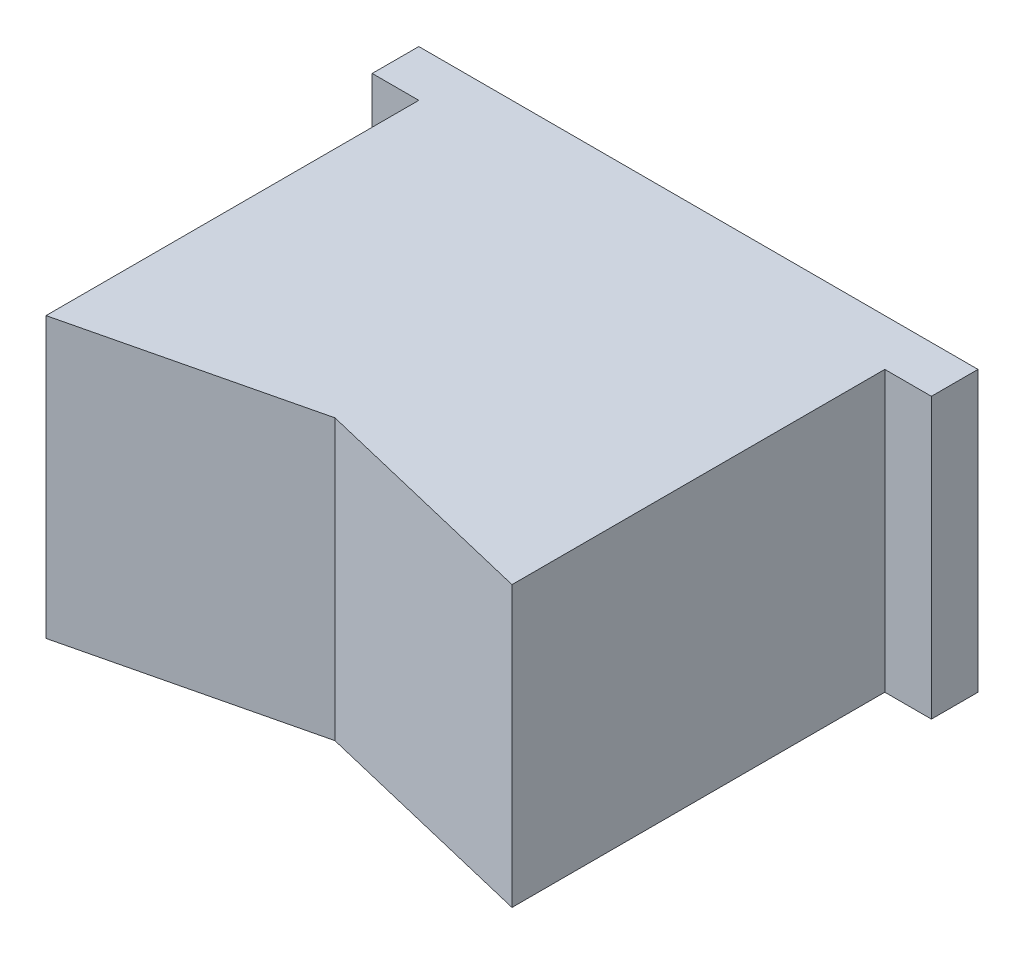
ISO-10303-21;
HEADER;
FILE_DESCRIPTION(('STEP AP214'),'2;1');
FILE_NAME('part.step','',(''),(''),'','','');
FILE_SCHEMA(('AUTOMOTIVE_DESIGN { 1 0 10303 214 1 1 1 1 }'));
ENDSEC;
DATA;
#1=APPLICATION_CONTEXT('core data for automotive mechanical design processes');
#2=APPLICATION_PROTOCOL_DEFINITION('international standard','automotive_design',2000,#1);
#3=PRODUCT_CONTEXT('',#1,'mechanical');
#4=PRODUCT('Part','Part','',(#3));
#5=PRODUCT_RELATED_PRODUCT_CATEGORY('part','',(#4));
#6=PRODUCT_DEFINITION_FORMATION('','',#4);
#7=PRODUCT_DEFINITION_CONTEXT('part definition',#1,'design');
#8=PRODUCT_DEFINITION('design','',#6,#7);
#9=PRODUCT_DEFINITION_SHAPE('','',#8);
#10=(LENGTH_UNIT() NAMED_UNIT(*) SI_UNIT(.MILLI.,.METRE.));
#11=(NAMED_UNIT(*) PLANE_ANGLE_UNIT() SI_UNIT($,.RADIAN.));
#12=(NAMED_UNIT(*) SI_UNIT($,.STERADIAN.) SOLID_ANGLE_UNIT());
#13=UNCERTAINTY_MEASURE_WITH_UNIT(LENGTH_MEASURE(1.E-05),#10,'distance_accuracy_value','');
#14=(GEOMETRIC_REPRESENTATION_CONTEXT(3) GLOBAL_UNCERTAINTY_ASSIGNED_CONTEXT((#13)) GLOBAL_UNIT_ASSIGNED_CONTEXT((#10,
#11,#12)) REPRESENTATION_CONTEXT('',''));
#15=CARTESIAN_POINT('',(0.,0.,0.));
#16=DIRECTION('',(0.,0.,1.));
#17=DIRECTION('',(1.,0.,0.));
#18=AXIS2_PLACEMENT_3D('',#15,#16,#17);
#19=CARTESIAN_POINT('',(0.,0.,2.5));
#20=DIRECTION('',(0.,0.,1.));
#21=DIRECTION('',(1.,0.,0.));
#22=AXIS2_PLACEMENT_3D('',#19,#20,#21);
#23=PLANE('',#22);
#24=DIRECTION('',(0.,1.,0.));
#25=VECTOR('',#24,1.);
#26=CARTESIAN_POINT('',(12.5,7.5,2.5));
#27=LINE('',#26,#25);
#28=CARTESIAN_POINT('',(12.5,-7.5,2.5));
#29=VERTEX_POINT('',#28);
#30=CARTESIAN_POINT('',(12.5,7.5,2.5));
#31=VERTEX_POINT('',#30);
#32=EDGE_CURVE('E48',#29,#31,#27,.T.);
#33=ORIENTED_EDGE('',*,*,#32,.F.);
#34=DIRECTION('',(1.,0.,0.));
#35=VECTOR('',#34,1.);
#36=CARTESIAN_POINT('',(-15.,-7.5,2.5));
#37=LINE('',#36,#35);
#38=CARTESIAN_POINT('',(15.,-7.5,2.5));
#39=VERTEX_POINT('',#38);
#40=EDGE_CURVE('E158',#29,#39,#37,.T.);
#41=ORIENTED_EDGE('',*,*,#40,.T.);
#42=DIRECTION('',(0.,1.,0.));
#43=VECTOR('',#42,1.);
#44=CARTESIAN_POINT('',(15.,7.5,2.5));
#45=LINE('',#44,#43);
#46=CARTESIAN_POINT('',(15.,7.5,2.5));
#47=VERTEX_POINT('',#46);
#48=EDGE_CURVE('E149',#39,#47,#45,.T.);
#49=ORIENTED_EDGE('',*,*,#48,.T.);
#50=DIRECTION('',(-1.,0.,0.));
#51=VECTOR('',#50,1.);
#52=CARTESIAN_POINT('',(-15.,7.5,2.5));
#53=LINE('',#52,#51);
#54=EDGE_CURVE('E154',#47,#31,#53,.T.);
#55=ORIENTED_EDGE('',*,*,#54,.T.);
#56=EDGE_LOOP('',(#33,#41,#49,#55));
#57=FACE_BOUND('',#56,.T.);
#58=ADVANCED_FACE('F33',(#57),#23,.T.);
#59=CARTESIAN_POINT('',(15.,7.5,2.5));
#60=DIRECTION('',(-1.,0.,0.));
#61=DIRECTION('',(0.,-1.,0.));
#62=AXIS2_PLACEMENT_3D('',#59,#60,#61);
#63=PLANE('',#62);
#64=DIRECTION('',(0.,1.,0.));
#65=VECTOR('',#64,1.);
#66=CARTESIAN_POINT('',(15.,7.5,0.));
#67=LINE('',#66,#65);
#68=CARTESIAN_POINT('',(15.,-7.5,0.));
#69=VERTEX_POINT('',#68);
#70=CARTESIAN_POINT('',(15.,7.5,0.));
#71=VERTEX_POINT('',#70);
#72=EDGE_CURVE('E148',#69,#71,#67,.T.);
#73=ORIENTED_EDGE('',*,*,#72,.T.);
#74=DIRECTION('',(0.,0.,-1.));
#75=VECTOR('',#74,1.);
#76=CARTESIAN_POINT('',(15.,7.5,2.5));
#77=LINE('',#76,#75);
#78=EDGE_CURVE('E11',#47,#71,#77,.T.);
#79=ORIENTED_EDGE('',*,*,#78,.F.);
#80=ORIENTED_EDGE('',*,*,#48,.F.);
#81=DIRECTION('',(0.,0.,-1.));
#82=VECTOR('',#81,1.);
#83=CARTESIAN_POINT('',(15.,-7.5,2.5));
#84=LINE('',#83,#82);
#85=EDGE_CURVE('E161',#39,#69,#84,.T.);
#86=ORIENTED_EDGE('',*,*,#85,.T.);
#87=EDGE_LOOP('',(#73,#79,#80,#86));
#88=FACE_BOUND('',#87,.T.);
#89=ADVANCED_FACE('F35',(#88),#63,.F.);
#90=CARTESIAN_POINT('',(-15.,7.5,2.5));
#91=DIRECTION('',(0.,-1.,0.));
#92=DIRECTION('',(0.,0.,-1.));
#93=AXIS2_PLACEMENT_3D('',#90,#91,#92);
#94=PLANE('',#93);
#95=DIRECTION('',(-0.972387301980517,0.,0.233372952475324));
#96=VECTOR('',#95,1.);
#97=CARTESIAN_POINT('',(-12.5,7.5,22.5));
#98=LINE('',#97,#96);
#99=CARTESIAN_POINT('',(0.,7.5,19.5));
#100=VERTEX_POINT('',#99);
#101=CARTESIAN_POINT('',(-12.5,7.5,22.5));
#102=VERTEX_POINT('',#101);
#103=EDGE_CURVE('E107',#100,#102,#98,.T.);
#104=ORIENTED_EDGE('',*,*,#103,.F.);
#105=DIRECTION('',(-0.972387301980517,0.,-0.233372952475324));
#106=VECTOR('',#105,1.);
#107=CARTESIAN_POINT('',(0.,7.5,19.5));
#108=LINE('',#107,#106);
#109=CARTESIAN_POINT('',(12.5,7.5,22.5));
#110=VERTEX_POINT('',#109);
#111=EDGE_CURVE('E115',#110,#100,#108,.T.);
#112=ORIENTED_EDGE('',*,*,#111,.F.);
#113=DIRECTION('',(0.,0.,-1.));
#114=VECTOR('',#113,1.);
#115=CARTESIAN_POINT('',(12.5,7.5,22.5));
#116=LINE('',#115,#114);
#117=EDGE_CURVE('E146',#110,#31,#116,.T.);
#118=ORIENTED_EDGE('',*,*,#117,.T.);
#119=ORIENTED_EDGE('',*,*,#54,.F.);
#120=ORIENTED_EDGE('',*,*,#78,.T.);
#121=DIRECTION('',(-1.,0.,0.));
#122=VECTOR('',#121,1.);
#123=CARTESIAN_POINT('',(-15.,7.5,0.));
#124=LINE('',#123,#122);
#125=CARTESIAN_POINT('',(-15.,7.5,0.));
#126=VERTEX_POINT('',#125);
#127=EDGE_CURVE('E164',#71,#126,#124,.T.);
#128=ORIENTED_EDGE('',*,*,#127,.T.);
#129=DIRECTION('',(0.,0.,-1.));
#130=VECTOR('',#129,1.);
#131=CARTESIAN_POINT('',(-15.,7.5,2.5));
#132=LINE('',#131,#130);
#133=CARTESIAN_POINT('',(-15.,7.5,2.5));
#134=VERTEX_POINT('',#133);
#135=EDGE_CURVE('E41',#134,#126,#132,.T.);
#136=ORIENTED_EDGE('',*,*,#135,.F.);
#137=CARTESIAN_POINT('',(-12.5,7.5,2.5));
#138=VERTEX_POINT('',#137);
#139=EDGE_CURVE('E152',#138,#134,#53,.T.);
#140=ORIENTED_EDGE('',*,*,#139,.F.);
#141=DIRECTION('',(0.,0.,-1.));
#142=VECTOR('',#141,1.);
#143=CARTESIAN_POINT('',(-12.5,7.5,22.5));
#144=LINE('',#143,#142);
#145=EDGE_CURVE('E126',#102,#138,#144,.T.);
#146=ORIENTED_EDGE('',*,*,#145,.F.);
#147=EDGE_LOOP('',(#104,#112,#118,#119,#120,#128,#136,#140,#146));
#148=FACE_BOUND('',#147,.T.);
#149=ADVANCED_FACE('F124',(#148),#94,.F.);
#150=CARTESIAN_POINT('',(-15.,7.5,2.5));
#151=DIRECTION('',(1.,0.,0.));
#152=DIRECTION('',(0.,1.,0.));
#153=AXIS2_PLACEMENT_3D('',#150,#151,#152);
#154=PLANE('',#153);
#155=DIRECTION('',(0.,-1.,0.));
#156=VECTOR('',#155,1.);
#157=CARTESIAN_POINT('',(-15.,7.5,0.));
#158=LINE('',#157,#156);
#159=CARTESIAN_POINT('',(-15.,-7.5,0.));
#160=VERTEX_POINT('',#159);
#161=EDGE_CURVE('E166',#126,#160,#158,.T.);
#162=ORIENTED_EDGE('',*,*,#161,.T.);
#163=DIRECTION('',(0.,0.,-1.));
#164=VECTOR('',#163,1.);
#165=CARTESIAN_POINT('',(-15.,-7.5,2.5));
#166=LINE('',#165,#164);
#167=CARTESIAN_POINT('',(-15.,-7.5,2.5));
#168=VERTEX_POINT('',#167);
#169=EDGE_CURVE('E171',#168,#160,#166,.T.);
#170=ORIENTED_EDGE('',*,*,#169,.F.);
#171=DIRECTION('',(0.,-1.,0.));
#172=VECTOR('',#171,1.);
#173=CARTESIAN_POINT('',(-15.,7.5,2.5));
#174=LINE('',#173,#172);
#175=EDGE_CURVE('E156',#134,#168,#174,.T.);
#176=ORIENTED_EDGE('',*,*,#175,.F.);
#177=ORIENTED_EDGE('',*,*,#135,.T.);
#178=EDGE_LOOP('',(#162,#170,#176,#177));
#179=FACE_BOUND('',#178,.T.);
#180=ADVANCED_FACE('F178',(#179),#154,.F.);
#181=CARTESIAN_POINT('',(-15.,-7.5,2.5));
#182=DIRECTION('',(0.,1.,0.));
#183=DIRECTION('',(0.,0.,1.));
#184=AXIS2_PLACEMENT_3D('',#181,#182,#183);
#185=PLANE('',#184);
#186=DIRECTION('',(0.,0.,-1.));
#187=VECTOR('',#186,1.);
#188=CARTESIAN_POINT('',(12.5,-7.5,22.5));
#189=LINE('',#188,#187);
#190=CARTESIAN_POINT('',(12.5,-7.5,22.5));
#191=VERTEX_POINT('',#190);
#192=EDGE_CURVE('E137',#191,#29,#189,.T.);
#193=ORIENTED_EDGE('',*,*,#192,.F.);
#194=DIRECTION('',(-0.972387301980518,0.,-0.233372952475324));
#195=VECTOR('',#194,1.);
#196=CARTESIAN_POINT('',(-18.0408472012103,-7.5,15.1701966717095));
#197=LINE('',#196,#195);
#198=CARTESIAN_POINT('',(0.,-7.5,19.5));
#199=VERTEX_POINT('',#198);
#200=EDGE_CURVE('E132',#191,#199,#197,.T.);
#201=ORIENTED_EDGE('',*,*,#200,.T.);
#202=DIRECTION('',(-0.972387301980517,0.,0.233372952475324));
#203=VECTOR('',#202,1.);
#204=CARTESIAN_POINT('',(-10.3252647503782,-7.5,21.9780635400908));
#205=LINE('',#204,#203);
#206=CARTESIAN_POINT('',(-12.5,-7.5,22.5));
#207=VERTEX_POINT('',#206);
#208=EDGE_CURVE('E110',#199,#207,#205,.T.);
#209=ORIENTED_EDGE('',*,*,#208,.T.);
#210=DIRECTION('',(0.,0.,-1.));
#211=VECTOR('',#210,1.);
#212=CARTESIAN_POINT('',(-12.5,-7.5,22.5));
#213=LINE('',#212,#211);
#214=CARTESIAN_POINT('',(-12.5,-7.5,2.5));
#215=VERTEX_POINT('',#214);
#216=EDGE_CURVE('E142',#207,#215,#213,.T.);
#217=ORIENTED_EDGE('',*,*,#216,.T.);
#218=EDGE_CURVE('E159',#168,#215,#37,.T.);
#219=ORIENTED_EDGE('',*,*,#218,.F.);
#220=ORIENTED_EDGE('',*,*,#169,.T.);
#221=DIRECTION('',(1.,0.,0.));
#222=VECTOR('',#221,1.);
#223=CARTESIAN_POINT('',(-15.,-7.5,0.));
#224=LINE('',#223,#222);
#225=EDGE_CURVE('E153',#160,#69,#224,.T.);
#226=ORIENTED_EDGE('',*,*,#225,.T.);
#227=ORIENTED_EDGE('',*,*,#85,.F.);
#228=ORIENTED_EDGE('',*,*,#40,.F.);
#229=EDGE_LOOP('',(#193,#201,#209,#217,#219,#220,#226,#227,#228));
#230=FACE_BOUND('',#229,.T.);
#231=ADVANCED_FACE('F187',(#230),#185,.F.);
#232=DIRECTION('',(0.,-1.,0.));
#233=VECTOR('',#232,1.);
#234=CARTESIAN_POINT('',(-12.5,7.5,2.5));
#235=LINE('',#234,#233);
#236=EDGE_CURVE('E56',#138,#215,#235,.T.);
#237=ORIENTED_EDGE('',*,*,#236,.F.);
#238=ORIENTED_EDGE('',*,*,#139,.T.);
#239=ORIENTED_EDGE('',*,*,#175,.T.);
#240=ORIENTED_EDGE('',*,*,#218,.T.);
#241=EDGE_LOOP('',(#237,#238,#239,#240));
#242=FACE_BOUND('',#241,.T.);
#243=ADVANCED_FACE('F204',(#242),#23,.T.);
#244=CARTESIAN_POINT('',(0.,0.,0.));
#245=DIRECTION('',(0.,0.,1.));
#246=DIRECTION('',(1.,0.,0.));
#247=AXIS2_PLACEMENT_3D('',#244,#245,#246);
#248=PLANE('',#247);
#249=CARTESIAN_POINT('',(7.,0.,0.));
#250=DIRECTION('',(0.,0.,-1.));
#251=DIRECTION('',(-1.,0.,0.));
#252=AXIS2_PLACEMENT_3D('',#249,#250,#251);
#253=CIRCLE('',#252,5.);
#254=CARTESIAN_POINT('',(2.,0.,0.));
#255=VERTEX_POINT('',#254);
#256=EDGE_CURVE('E331',#255,#255,#253,.T.);
#257=ORIENTED_EDGE('',*,*,#256,.F.);
#258=EDGE_LOOP('',(#257));
#259=FACE_BOUND('',#258,.T.);
#260=CARTESIAN_POINT('',(-7.,0.,0.));
#261=DIRECTION('',(0.,0.,-1.));
#262=DIRECTION('',(-1.,0.,0.));
#263=AXIS2_PLACEMENT_3D('',#260,#261,#262);
#264=CIRCLE('',#263,5.);
#265=CARTESIAN_POINT('',(-12.,0.,0.));
#266=VERTEX_POINT('',#265);
#267=EDGE_CURVE('E338',#266,#266,#264,.T.);
#268=ORIENTED_EDGE('',*,*,#267,.F.);
#269=EDGE_LOOP('',(#268));
#270=FACE_BOUND('',#269,.T.);
#271=ORIENTED_EDGE('',*,*,#72,.F.);
#272=ORIENTED_EDGE('',*,*,#225,.F.);
#273=ORIENTED_EDGE('',*,*,#161,.F.);
#274=ORIENTED_EDGE('',*,*,#127,.F.);
#275=EDGE_LOOP('',(#271,#272,#273,#274));
#276=FACE_BOUND('',#275,.T.);
#277=ADVANCED_FACE('F183',(#259,#270,#276),#248,.F.);
#278=CARTESIAN_POINT('',(12.5,7.5,22.5));
#279=DIRECTION('',(-1.,0.,0.));
#280=DIRECTION('',(0.,-1.,0.));
#281=AXIS2_PLACEMENT_3D('',#278,#279,#280);
#282=PLANE('',#281);
#283=ORIENTED_EDGE('',*,*,#32,.T.);
#284=ORIENTED_EDGE('',*,*,#117,.F.);
#285=DIRECTION('',(0.,1.,0.));
#286=VECTOR('',#285,1.);
#287=CARTESIAN_POINT('',(12.5,7.5,22.5));
#288=LINE('',#287,#286);
#289=EDGE_CURVE('E118',#191,#110,#288,.T.);
#290=ORIENTED_EDGE('',*,*,#289,.F.);
#291=ORIENTED_EDGE('',*,*,#192,.T.);
#292=EDGE_LOOP('',(#283,#284,#290,#291));
#293=FACE_BOUND('',#292,.T.);
#294=ADVANCED_FACE('F193',(#293),#282,.F.);
#295=CARTESIAN_POINT('',(-12.5,7.5,22.5));
#296=DIRECTION('',(1.,0.,0.));
#297=DIRECTION('',(0.,1.,0.));
#298=AXIS2_PLACEMENT_3D('',#295,#296,#297);
#299=PLANE('',#298);
#300=ORIENTED_EDGE('',*,*,#236,.T.);
#301=ORIENTED_EDGE('',*,*,#216,.F.);
#302=DIRECTION('',(0.,-1.,0.));
#303=VECTOR('',#302,1.);
#304=CARTESIAN_POINT('',(-12.5,7.5,22.5));
#305=LINE('',#304,#303);
#306=EDGE_CURVE('E135',#102,#207,#305,.T.);
#307=ORIENTED_EDGE('',*,*,#306,.F.);
#308=ORIENTED_EDGE('',*,*,#145,.T.);
#309=EDGE_LOOP('',(#300,#301,#307,#308));
#310=FACE_BOUND('',#309,.T.);
#311=ADVANCED_FACE('F195',(#310),#299,.F.);
#312=CARTESIAN_POINT('',(0.,-12.5,19.5));
#313=DIRECTION('',(0.233372952475324,0.,-0.972387301980517));
#314=DIRECTION('',(-0.972387301980518,0.,-0.233372952475324));
#315=AXIS2_PLACEMENT_3D('',#312,#313,#314);
#316=PLANE('',#315);
#317=ORIENTED_EDGE('',*,*,#289,.T.);
#318=ORIENTED_EDGE('',*,*,#111,.T.);
#319=DIRECTION('',(0.,1.,0.));
#320=VECTOR('',#319,1.);
#321=CARTESIAN_POINT('',(0.,-12.5,19.5));
#322=LINE('',#321,#320);
#323=EDGE_CURVE('E103',#199,#100,#322,.T.);
#324=ORIENTED_EDGE('',*,*,#323,.F.);
#325=ORIENTED_EDGE('',*,*,#200,.F.);
#326=EDGE_LOOP('',(#317,#318,#324,#325));
#327=FACE_BOUND('',#326,.T.);
#328=ADVANCED_FACE('F116',(#327),#316,.F.);
#329=CARTESIAN_POINT('',(-12.5,-12.5,22.5));
#330=DIRECTION('',(-0.233372952475324,0.,-0.972387301980517));
#331=DIRECTION('',(-0.972387301980517,0.,0.233372952475324));
#332=AXIS2_PLACEMENT_3D('',#329,#330,#331);
#333=PLANE('',#332);
#334=ORIENTED_EDGE('',*,*,#323,.T.);
#335=ORIENTED_EDGE('',*,*,#103,.T.);
#336=ORIENTED_EDGE('',*,*,#306,.T.);
#337=ORIENTED_EDGE('',*,*,#208,.F.);
#338=EDGE_LOOP('',(#334,#335,#336,#337));
#339=FACE_BOUND('',#338,.T.);
#340=ADVANCED_FACE('F105',(#339),#333,.F.);
#341=CARTESIAN_POINT('',(-7.,0.,4.6));
#342=DIRECTION('',(0.,0.,-1.));
#343=DIRECTION('',(-1.,0.,0.));
#344=AXIS2_PLACEMENT_3D('',#341,#342,#343);
#345=CYLINDRICAL_SURFACE('',#344,5.);
#346=CARTESIAN_POINT('',(-7.,0.,4.6));
#347=DIRECTION('',(0.,0.,-1.));
#348=DIRECTION('',(-1.,0.,0.));
#349=AXIS2_PLACEMENT_3D('',#346,#347,#348);
#350=CIRCLE('',#349,5.);
#351=CARTESIAN_POINT('',(-12.,0.,4.6));
#352=VERTEX_POINT('',#351);
#353=EDGE_CURVE('E334',#352,#352,#350,.T.);
#354=ORIENTED_EDGE('',*,*,#353,.F.);
#355=EDGE_LOOP('',(#354));
#356=FACE_BOUND('',#355,.T.);
#357=ORIENTED_EDGE('',*,*,#267,.T.);
#358=EDGE_LOOP('',(#357));
#359=FACE_BOUND('',#358,.T.);
#360=ADVANCED_FACE('F286',(#356,#359),#345,.F.);
#361=CARTESIAN_POINT('',(-7.,0.,4.6));
#362=DIRECTION('',(0.,0.,-1.));
#363=DIRECTION('',(-1.,0.,0.));
#364=AXIS2_PLACEMENT_3D('',#361,#362,#363);
#365=PLANE('',#364);
#366=ORIENTED_EDGE('',*,*,#353,.T.);
#367=EDGE_LOOP('',(#366));
#368=FACE_BOUND('',#367,.T.);
#369=ADVANCED_FACE('F293',(#368),#365,.T.);
#370=CARTESIAN_POINT('',(7.,0.,4.6));
#371=DIRECTION('',(0.,0.,-1.));
#372=DIRECTION('',(-1.,0.,0.));
#373=AXIS2_PLACEMENT_3D('',#370,#371,#372);
#374=CYLINDRICAL_SURFACE('',#373,5.);
#375=CARTESIAN_POINT('',(7.,0.,4.6));
#376=DIRECTION('',(0.,0.,-1.));
#377=DIRECTION('',(-1.,0.,0.));
#378=AXIS2_PLACEMENT_3D('',#375,#376,#377);
#379=CIRCLE('',#378,5.);
#380=CARTESIAN_POINT('',(2.,0.,4.6));
#381=VERTEX_POINT('',#380);
#382=EDGE_CURVE('E122',#381,#381,#379,.T.);
#383=ORIENTED_EDGE('',*,*,#382,.F.);
#384=EDGE_LOOP('',(#383));
#385=FACE_BOUND('',#384,.T.);
#386=ORIENTED_EDGE('',*,*,#256,.T.);
#387=EDGE_LOOP('',(#386));
#388=FACE_BOUND('',#387,.T.);
#389=ADVANCED_FACE('F302',(#385,#388),#374,.F.);
#390=CARTESIAN_POINT('',(7.,0.,4.6));
#391=DIRECTION('',(0.,0.,-1.));
#392=DIRECTION('',(-1.,0.,0.));
#393=AXIS2_PLACEMENT_3D('',#390,#391,#392);
#394=PLANE('',#393);
#395=ORIENTED_EDGE('',*,*,#382,.T.);
#396=EDGE_LOOP('',(#395));
#397=FACE_BOUND('',#396,.T.);
#398=ADVANCED_FACE('F311',(#397),#394,.T.);
#399=CLOSED_SHELL('',(#58,#89,#149,#180,#231,#243,#277,#294,#311,#328,#340,#360,#369,#389,#398));
#400=MANIFOLD_SOLID_BREP('B2',#399);
#401=ADVANCED_BREP_SHAPE_REPRESENTATION('',(#18,#400),#14);
#402=SHAPE_DEFINITION_REPRESENTATION(#9,#401);
ENDSEC;
END-ISO-10303-21;
